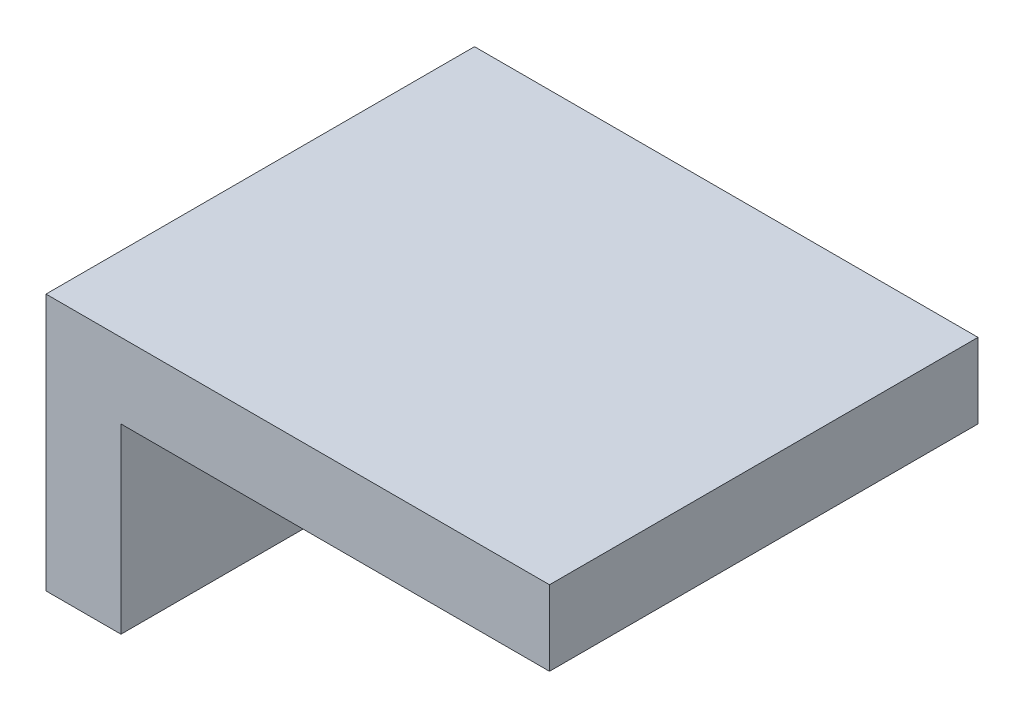
ISO-10303-21;
HEADER;
FILE_DESCRIPTION(('STEP AP214'),'2;1');
FILE_NAME('part.step','',(''),(''),'','','');
FILE_SCHEMA(('AUTOMOTIVE_DESIGN { 1 0 10303 214 1 1 1 1 }'));
ENDSEC;
DATA;
#1=APPLICATION_CONTEXT('core data for automotive mechanical design processes');
#2=APPLICATION_PROTOCOL_DEFINITION('international standard','automotive_design',2000,#1);
#3=PRODUCT_CONTEXT('',#1,'mechanical');
#4=PRODUCT('Part','Part','',(#3));
#5=PRODUCT_RELATED_PRODUCT_CATEGORY('part','',(#4));
#6=PRODUCT_DEFINITION_FORMATION('','',#4);
#7=PRODUCT_DEFINITION_CONTEXT('part definition',#1,'design');
#8=PRODUCT_DEFINITION('design','',#6,#7);
#9=PRODUCT_DEFINITION_SHAPE('','',#8);
#10=(LENGTH_UNIT() NAMED_UNIT(*) SI_UNIT(.MILLI.,.METRE.));
#11=(NAMED_UNIT(*) PLANE_ANGLE_UNIT() SI_UNIT($,.RADIAN.));
#12=(NAMED_UNIT(*) SI_UNIT($,.STERADIAN.) SOLID_ANGLE_UNIT());
#13=UNCERTAINTY_MEASURE_WITH_UNIT(LENGTH_MEASURE(1.E-05),#10,'distance_accuracy_value','');
#14=(GEOMETRIC_REPRESENTATION_CONTEXT(3) GLOBAL_UNCERTAINTY_ASSIGNED_CONTEXT((#13)) GLOBAL_UNIT_ASSIGNED_CONTEXT((#10,
#11,#12)) REPRESENTATION_CONTEXT('',''));
#15=CARTESIAN_POINT('',(0.,0.,0.));
#16=DIRECTION('',(0.,0.,1.));
#17=DIRECTION('',(1.,0.,0.));
#18=AXIS2_PLACEMENT_3D('',#15,#16,#17);
#19=CARTESIAN_POINT('',(7.,0.,0.));
#20=DIRECTION('',(-1.,0.,0.));
#21=DIRECTION('',(0.,0.,1.));
#22=AXIS2_PLACEMENT_3D('',#19,#20,#21);
#23=PLANE('',#22);
#24=CARTESIAN_POINT('',(7.,0.,-10.0488873941524));
#25=DIRECTION('',(-1.,0.,0.));
#26=DIRECTION('',(0.,0.,1.));
#27=AXIS2_PLACEMENT_3D('',#24,#25,#26);
#28=CIRCLE('',#27,2.5);
#29=CARTESIAN_POINT('',(7.,0.,-7.54888739415238));
#30=VERTEX_POINT('',#29);
#31=EDGE_CURVE('E155',#30,#30,#28,.T.);
#32=ORIENTED_EDGE('',*,*,#31,.T.);
#33=EDGE_LOOP('',(#32));
#34=FACE_BOUND('',#33,.T.);
#35=CARTESIAN_POINT('',(7.,0.,10.0488873941524));
#36=DIRECTION('',(-1.,0.,0.));
#37=DIRECTION('',(0.,0.,1.));
#38=AXIS2_PLACEMENT_3D('',#35,#36,#37);
#39=CIRCLE('',#38,2.5);
#40=CARTESIAN_POINT('',(7.,0.,12.5488873941524));
#41=VERTEX_POINT('',#40);
#42=EDGE_CURVE('E175',#41,#41,#39,.T.);
#43=ORIENTED_EDGE('',*,*,#42,.T.);
#44=EDGE_LOOP('',(#43));
#45=FACE_BOUND('',#44,.T.);
#46=DIRECTION('',(0.,0.,-1.));
#47=VECTOR('',#46,1.);
#48=CARTESIAN_POINT('',(7.,5.,20.));
#49=LINE('',#48,#47);
#50=CARTESIAN_POINT('',(7.,5.,20.));
#51=VERTEX_POINT('',#50);
#52=CARTESIAN_POINT('',(7.,5.,-20.));
#53=VERTEX_POINT('',#52);
#54=EDGE_CURVE('E59',#51,#53,#49,.T.);
#55=ORIENTED_EDGE('',*,*,#54,.F.);
#56=DIRECTION('',(0.,-1.,0.));
#57=VECTOR('',#56,1.);
#58=CARTESIAN_POINT('',(7.,-12.,20.));
#59=LINE('',#58,#57);
#60=CARTESIAN_POINT('',(7.,-12.,20.));
#61=VERTEX_POINT('',#60);
#62=EDGE_CURVE('E158',#51,#61,#59,.T.);
#63=ORIENTED_EDGE('',*,*,#62,.T.);
#64=DIRECTION('',(0.,0.,-1.));
#65=VECTOR('',#64,1.);
#66=CARTESIAN_POINT('',(7.,-12.,20.));
#67=LINE('',#66,#65);
#68=CARTESIAN_POINT('',(7.,-12.,-20.));
#69=VERTEX_POINT('',#68);
#70=EDGE_CURVE('E65',#61,#69,#67,.T.);
#71=ORIENTED_EDGE('',*,*,#70,.T.);
#72=DIRECTION('',(0.,1.,0.));
#73=VECTOR('',#72,1.);
#74=CARTESIAN_POINT('',(7.,-12.,-20.));
#75=LINE('',#74,#73);
#76=EDGE_CURVE('E95',#69,#53,#75,.T.);
#77=ORIENTED_EDGE('',*,*,#76,.T.);
#78=EDGE_LOOP('',(#55,#63,#71,#77));
#79=FACE_BOUND('',#78,.T.);
#80=ADVANCED_FACE('F43',(#34,#45,#79),#23,.F.);
#81=CARTESIAN_POINT('',(7.,-12.,-20.));
#82=DIRECTION('',(0.,0.,1.));
#83=DIRECTION('',(1.,0.,0.));
#84=AXIS2_PLACEMENT_3D('',#81,#82,#83);
#85=PLANE('',#84);
#86=DIRECTION('',(0.,1.,0.));
#87=VECTOR('',#86,1.);
#88=CARTESIAN_POINT('',(0.,-12.,-20.));
#89=LINE('',#88,#87);
#90=CARTESIAN_POINT('',(0.,-12.,-20.));
#91=VERTEX_POINT('',#90);
#92=CARTESIAN_POINT('',(0.,12.,-20.));
#93=VERTEX_POINT('',#92);
#94=EDGE_CURVE('E101',#91,#93,#89,.T.);
#95=ORIENTED_EDGE('',*,*,#94,.T.);
#96=DIRECTION('',(-1.,0.,0.));
#97=VECTOR('',#96,1.);
#98=CARTESIAN_POINT('',(7.,12.,-20.));
#99=LINE('',#98,#97);
#100=CARTESIAN_POINT('',(47.,12.,-20.));
#101=VERTEX_POINT('',#100);
#102=EDGE_CURVE('E11',#101,#93,#99,.T.);
#103=ORIENTED_EDGE('',*,*,#102,.F.);
#104=DIRECTION('',(0.,1.,0.));
#105=VECTOR('',#104,1.);
#106=CARTESIAN_POINT('',(47.,12.,-20.));
#107=LINE('',#106,#105);
#108=CARTESIAN_POINT('',(47.,5.,-20.));
#109=VERTEX_POINT('',#108);
#110=EDGE_CURVE('E144',#109,#101,#107,.T.);
#111=ORIENTED_EDGE('',*,*,#110,.F.);
#112=DIRECTION('',(-1.,0.,0.));
#113=VECTOR('',#112,1.);
#114=CARTESIAN_POINT('',(47.,5.,-20.));
#115=LINE('',#114,#113);
#116=EDGE_CURVE('E114',#109,#53,#115,.T.);
#117=ORIENTED_EDGE('',*,*,#116,.T.);
#118=ORIENTED_EDGE('',*,*,#76,.F.);
#119=DIRECTION('',(-1.,0.,0.));
#120=VECTOR('',#119,1.);
#121=CARTESIAN_POINT('',(7.,-12.,-20.));
#122=LINE('',#121,#120);
#123=EDGE_CURVE('E87',#69,#91,#122,.T.);
#124=ORIENTED_EDGE('',*,*,#123,.T.);
#125=EDGE_LOOP('',(#95,#103,#111,#117,#118,#124));
#126=FACE_BOUND('',#125,.T.);
#127=ADVANCED_FACE('F45',(#126),#85,.F.);
#128=CARTESIAN_POINT('',(7.,12.,20.));
#129=DIRECTION('',(0.,-1.,0.));
#130=DIRECTION('',(0.,0.,-1.));
#131=AXIS2_PLACEMENT_3D('',#128,#129,#130);
#132=PLANE('',#131);
#133=DIRECTION('',(0.,0.,1.));
#134=VECTOR('',#133,1.);
#135=CARTESIAN_POINT('',(0.,12.,20.));
#136=LINE('',#135,#134);
#137=CARTESIAN_POINT('',(0.,12.,20.));
#138=VERTEX_POINT('',#137);
#139=EDGE_CURVE('E106',#93,#138,#136,.T.);
#140=ORIENTED_EDGE('',*,*,#139,.T.);
#141=DIRECTION('',(-1.,0.,0.));
#142=VECTOR('',#141,1.);
#143=CARTESIAN_POINT('',(7.,12.,20.));
#144=LINE('',#143,#142);
#145=CARTESIAN_POINT('',(47.,12.,20.));
#146=VERTEX_POINT('',#145);
#147=EDGE_CURVE('E52',#146,#138,#144,.T.);
#148=ORIENTED_EDGE('',*,*,#147,.F.);
#149=DIRECTION('',(0.,0.,1.));
#150=VECTOR('',#149,1.);
#151=CARTESIAN_POINT('',(47.,12.,20.));
#152=LINE('',#151,#150);
#153=EDGE_CURVE('E136',#101,#146,#152,.T.);
#154=ORIENTED_EDGE('',*,*,#153,.F.);
#155=ORIENTED_EDGE('',*,*,#102,.T.);
#156=EDGE_LOOP('',(#140,#148,#154,#155));
#157=FACE_BOUND('',#156,.T.);
#158=ADVANCED_FACE('F134',(#157),#132,.F.);
#159=CARTESIAN_POINT('',(7.,-12.,20.));
#160=DIRECTION('',(0.,0.,-1.));
#161=DIRECTION('',(-1.,0.,0.));
#162=AXIS2_PLACEMENT_3D('',#159,#160,#161);
#163=PLANE('',#162);
#164=DIRECTION('',(0.,-1.,0.));
#165=VECTOR('',#164,1.);
#166=CARTESIAN_POINT('',(0.,-12.,20.));
#167=LINE('',#166,#165);
#168=CARTESIAN_POINT('',(0.,-12.,20.));
#169=VERTEX_POINT('',#168);
#170=EDGE_CURVE('E96',#138,#169,#167,.T.);
#171=ORIENTED_EDGE('',*,*,#170,.T.);
#172=DIRECTION('',(-1.,0.,0.));
#173=VECTOR('',#172,1.);
#174=CARTESIAN_POINT('',(7.,-12.,20.));
#175=LINE('',#174,#173);
#176=EDGE_CURVE('E90',#61,#169,#175,.T.);
#177=ORIENTED_EDGE('',*,*,#176,.F.);
#178=ORIENTED_EDGE('',*,*,#62,.F.);
#179=DIRECTION('',(-1.,0.,0.));
#180=VECTOR('',#179,1.);
#181=CARTESIAN_POINT('',(47.,5.,20.));
#182=LINE('',#181,#180);
#183=CARTESIAN_POINT('',(47.,5.,20.));
#184=VERTEX_POINT('',#183);
#185=EDGE_CURVE('E108',#184,#51,#182,.T.);
#186=ORIENTED_EDGE('',*,*,#185,.F.);
#187=DIRECTION('',(0.,-1.,0.));
#188=VECTOR('',#187,1.);
#189=CARTESIAN_POINT('',(47.,12.,20.));
#190=LINE('',#189,#188);
#191=EDGE_CURVE('E130',#146,#184,#190,.T.);
#192=ORIENTED_EDGE('',*,*,#191,.F.);
#193=ORIENTED_EDGE('',*,*,#147,.T.);
#194=EDGE_LOOP('',(#171,#177,#178,#186,#192,#193));
#195=FACE_BOUND('',#194,.T.);
#196=ADVANCED_FACE('F127',(#195),#163,.F.);
#197=CARTESIAN_POINT('',(7.,-12.,20.));
#198=DIRECTION('',(0.,1.,0.));
#199=DIRECTION('',(0.,0.,1.));
#200=AXIS2_PLACEMENT_3D('',#197,#198,#199);
#201=PLANE('',#200);
#202=DIRECTION('',(0.,0.,-1.));
#203=VECTOR('',#202,1.);
#204=CARTESIAN_POINT('',(0.,-12.,20.));
#205=LINE('',#204,#203);
#206=EDGE_CURVE('E84',#169,#91,#205,.T.);
#207=ORIENTED_EDGE('',*,*,#206,.T.);
#208=ORIENTED_EDGE('',*,*,#123,.F.);
#209=ORIENTED_EDGE('',*,*,#70,.F.);
#210=ORIENTED_EDGE('',*,*,#176,.T.);
#211=EDGE_LOOP('',(#207,#208,#209,#210));
#212=FACE_BOUND('',#211,.T.);
#213=ADVANCED_FACE('F86',(#212),#201,.F.);
#214=CARTESIAN_POINT('',(0.,0.,0.));
#215=DIRECTION('',(-1.,0.,0.));
#216=DIRECTION('',(0.,0.,1.));
#217=AXIS2_PLACEMENT_3D('',#214,#215,#216);
#218=PLANE('',#217);
#219=CARTESIAN_POINT('',(0.,0.,-10.0488873941524));
#220=DIRECTION('',(-1.,0.,0.));
#221=DIRECTION('',(0.,0.,1.));
#222=AXIS2_PLACEMENT_3D('',#219,#220,#221);
#223=CIRCLE('',#222,2.5);
#224=CARTESIAN_POINT('',(0.,0.,-7.54888739415238));
#225=VERTEX_POINT('',#224);
#226=EDGE_CURVE('E179',#225,#225,#223,.T.);
#227=ORIENTED_EDGE('',*,*,#226,.F.);
#228=EDGE_LOOP('',(#227));
#229=FACE_BOUND('',#228,.T.);
#230=CARTESIAN_POINT('',(0.,0.,10.0488873941524));
#231=DIRECTION('',(-1.,0.,0.));
#232=DIRECTION('',(0.,0.,-1.));
#233=AXIS2_PLACEMENT_3D('',#230,#231,#232);
#234=CIRCLE('',#233,2.5);
#235=CARTESIAN_POINT('',(0.,0.,7.54888739415238));
#236=VERTEX_POINT('',#235);
#237=EDGE_CURVE('E180',#236,#236,#234,.T.);
#238=ORIENTED_EDGE('',*,*,#237,.F.);
#239=EDGE_LOOP('',(#238));
#240=FACE_BOUND('',#239,.T.);
#241=ORIENTED_EDGE('',*,*,#94,.F.);
#242=ORIENTED_EDGE('',*,*,#206,.F.);
#243=ORIENTED_EDGE('',*,*,#170,.F.);
#244=ORIENTED_EDGE('',*,*,#139,.F.);
#245=EDGE_LOOP('',(#241,#242,#243,#244));
#246=FACE_BOUND('',#245,.T.);
#247=ADVANCED_FACE('F105',(#229,#240,#246),#218,.T.);
#248=CARTESIAN_POINT('',(47.,5.,20.));
#249=DIRECTION('',(0.,1.,0.));
#250=DIRECTION('',(0.,0.,1.));
#251=AXIS2_PLACEMENT_3D('',#248,#249,#250);
#252=PLANE('',#251);
#253=ORIENTED_EDGE('',*,*,#54,.T.);
#254=ORIENTED_EDGE('',*,*,#116,.F.);
#255=DIRECTION('',(0.,0.,-1.));
#256=VECTOR('',#255,1.);
#257=CARTESIAN_POINT('',(47.,5.,20.));
#258=LINE('',#257,#256);
#259=EDGE_CURVE('E150',#184,#109,#258,.T.);
#260=ORIENTED_EDGE('',*,*,#259,.F.);
#261=ORIENTED_EDGE('',*,*,#185,.T.);
#262=EDGE_LOOP('',(#253,#254,#260,#261));
#263=FACE_BOUND('',#262,.T.);
#264=ADVANCED_FACE('F163',(#263),#252,.F.);
#265=CARTESIAN_POINT('',(47.,0.,0.));
#266=DIRECTION('',(1.,0.,0.));
#267=DIRECTION('',(0.,0.,-1.));
#268=AXIS2_PLACEMENT_3D('',#265,#266,#267);
#269=PLANE('',#268);
#270=ORIENTED_EDGE('',*,*,#191,.T.);
#271=ORIENTED_EDGE('',*,*,#259,.T.);
#272=ORIENTED_EDGE('',*,*,#110,.T.);
#273=ORIENTED_EDGE('',*,*,#153,.T.);
#274=EDGE_LOOP('',(#270,#271,#272,#273));
#275=FACE_BOUND('',#274,.T.);
#276=ADVANCED_FACE('F140',(#275),#269,.T.);
#277=CARTESIAN_POINT('',(14.,0.,10.0488873941524));
#278=DIRECTION('',(-1.,0.,0.));
#279=DIRECTION('',(0.,0.,1.));
#280=AXIS2_PLACEMENT_3D('',#277,#278,#279);
#281=CYLINDRICAL_SURFACE('',#280,2.5);
#282=ORIENTED_EDGE('',*,*,#237,.T.);
#283=EDGE_LOOP('',(#282));
#284=FACE_BOUND('',#283,.T.);
#285=ORIENTED_EDGE('',*,*,#42,.F.);
#286=EDGE_LOOP('',(#285));
#287=FACE_BOUND('',#286,.T.);
#288=ADVANCED_FACE('F196',(#284,#287),#281,.F.);
#289=CARTESIAN_POINT('',(14.,0.,-10.0488873941524));
#290=DIRECTION('',(-1.,0.,0.));
#291=DIRECTION('',(0.,0.,1.));
#292=AXIS2_PLACEMENT_3D('',#289,#290,#291);
#293=CYLINDRICAL_SURFACE('',#292,2.5);
#294=ORIENTED_EDGE('',*,*,#226,.T.);
#295=EDGE_LOOP('',(#294));
#296=FACE_BOUND('',#295,.T.);
#297=ORIENTED_EDGE('',*,*,#31,.F.);
#298=EDGE_LOOP('',(#297));
#299=FACE_BOUND('',#298,.T.);
#300=ADVANCED_FACE('F188',(#296,#299),#293,.F.);
#301=CLOSED_SHELL('',(#80,#127,#158,#196,#213,#247,#264,#276,#288,#300));
#302=MANIFOLD_SOLID_BREP('B2',#301);
#303=ADVANCED_BREP_SHAPE_REPRESENTATION('',(#18,#302),#14);
#304=SHAPE_DEFINITION_REPRESENTATION(#9,#303);
ENDSEC;
END-ISO-10303-21;
